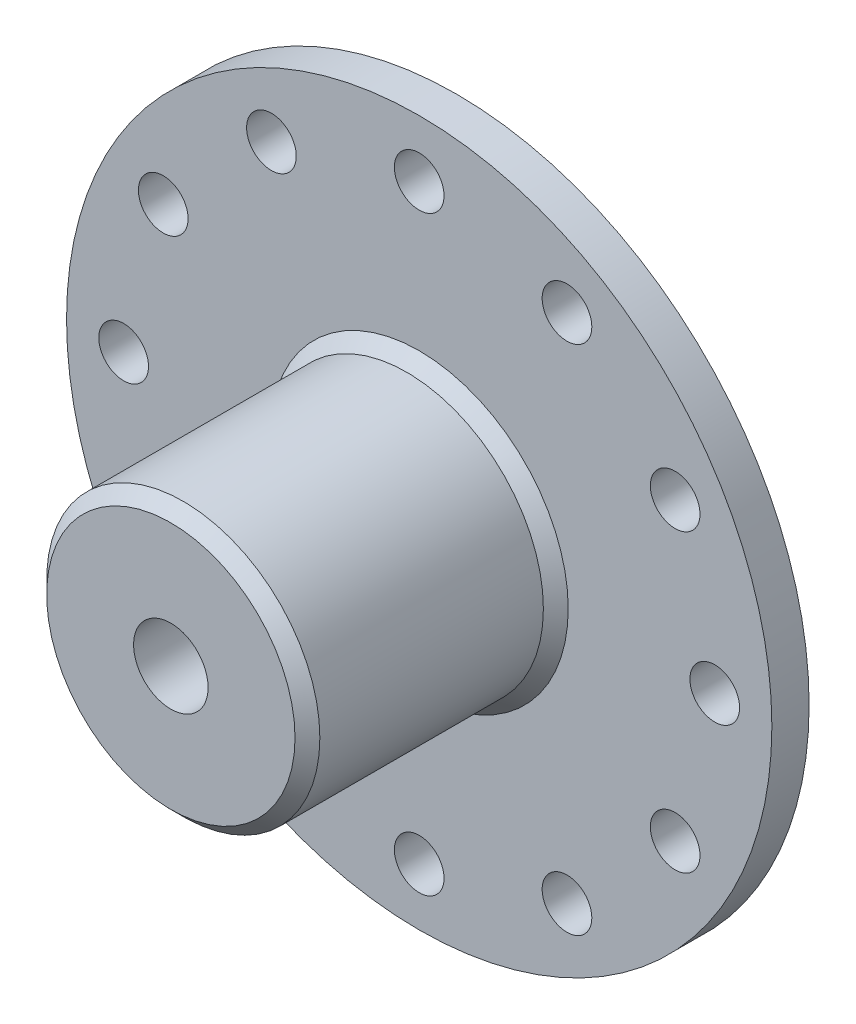
ISO-10303-21;
HEADER;
FILE_DESCRIPTION(('STEP AP214'),'2;1');
FILE_NAME('part.step','',(''),(''),'','','');
FILE_SCHEMA(('AUTOMOTIVE_DESIGN { 1 0 10303 214 1 1 1 1 }'));
ENDSEC;
DATA;
#1=APPLICATION_CONTEXT('core data for automotive mechanical design processes');
#2=APPLICATION_PROTOCOL_DEFINITION('international standard','automotive_design',2000,#1);
#3=PRODUCT_CONTEXT('',#1,'mechanical');
#4=PRODUCT('Part','Part','',(#3));
#5=PRODUCT_RELATED_PRODUCT_CATEGORY('part','',(#4));
#6=PRODUCT_DEFINITION_FORMATION('','',#4);
#7=PRODUCT_DEFINITION_CONTEXT('part definition',#1,'design');
#8=PRODUCT_DEFINITION('design','',#6,#7);
#9=PRODUCT_DEFINITION_SHAPE('','',#8);
#10=(LENGTH_UNIT() NAMED_UNIT(*) SI_UNIT(.MILLI.,.METRE.));
#11=(NAMED_UNIT(*) PLANE_ANGLE_UNIT() SI_UNIT($,.RADIAN.));
#12=(NAMED_UNIT(*) SI_UNIT($,.STERADIAN.) SOLID_ANGLE_UNIT());
#13=UNCERTAINTY_MEASURE_WITH_UNIT(LENGTH_MEASURE(1.E-05),#10,'distance_accuracy_value','');
#14=(GEOMETRIC_REPRESENTATION_CONTEXT(3) GLOBAL_UNCERTAINTY_ASSIGNED_CONTEXT((#13)) GLOBAL_UNIT_ASSIGNED_CONTEXT((#10,
#11,#12)) REPRESENTATION_CONTEXT('',''));
#15=CARTESIAN_POINT('',(0.,0.,0.));
#16=DIRECTION('',(0.,0.,1.));
#17=DIRECTION('',(1.,0.,0.));
#18=AXIS2_PLACEMENT_3D('',#15,#16,#17);
#19=CARTESIAN_POINT('',(0.,0.,3.));
#20=DIRECTION('',(0.,0.,-1.));
#21=DIRECTION('',(-1.,0.,0.));
#22=AXIS2_PLACEMENT_3D('',#19,#20,#21);
#23=CYLINDRICAL_SURFACE('',#22,28.4);
#24=CARTESIAN_POINT('',(0.,0.,3.));
#25=DIRECTION('',(0.,0.,1.));
#26=DIRECTION('',(1.,0.,0.));
#27=AXIS2_PLACEMENT_3D('',#24,#25,#26);
#28=CIRCLE('',#27,28.4);
#29=CARTESIAN_POINT('',(28.4,0.,3.));
#30=VERTEX_POINT('',#29);
#31=EDGE_CURVE('E62',#30,#30,#28,.T.);
#32=ORIENTED_EDGE('',*,*,#31,.F.);
#33=EDGE_LOOP('',(#32));
#34=FACE_BOUND('',#33,.T.);
#35=CARTESIAN_POINT('',(0.,0.,0.));
#36=DIRECTION('',(0.,0.,1.));
#37=DIRECTION('',(1.,0.,0.));
#38=AXIS2_PLACEMENT_3D('',#35,#36,#37);
#39=CIRCLE('',#38,28.4);
#40=CARTESIAN_POINT('',(28.4,0.,0.));
#41=VERTEX_POINT('',#40);
#42=EDGE_CURVE('E72',#41,#41,#39,.T.);
#43=ORIENTED_EDGE('',*,*,#42,.T.);
#44=EDGE_LOOP('',(#43));
#45=FACE_BOUND('',#44,.T.);
#46=ADVANCED_FACE('F42',(#34,#45),#23,.T.);
#47=CARTESIAN_POINT('',(0.,0.,3.));
#48=DIRECTION('',(0.,0.,1.));
#49=DIRECTION('',(1.,0.,0.));
#50=AXIS2_PLACEMENT_3D('',#47,#48,#49);
#51=PLANE('',#50);
#52=CARTESIAN_POINT('',(-11.8999999999999,20.6114046100697,3.));
#53=DIRECTION('',(0.,0.,1.));
#54=DIRECTION('',(0.499999999999998,0.86602540378444,0.));
#55=AXIS2_PLACEMENT_3D('',#52,#53,#54);
#56=CIRCLE('',#55,2.00000000000002);
#57=CARTESIAN_POINT('',(-10.8999999999999,22.3434554176386,3.));
#58=VERTEX_POINT('',#57);
#59=EDGE_CURVE('E208',#58,#58,#56,.T.);
#60=ORIENTED_EDGE('',*,*,#59,.F.);
#61=EDGE_LOOP('',(#60));
#62=FACE_BOUND('',#61,.T.);
#63=CARTESIAN_POINT('',(-20.6114046100696,11.9000000000001,3.));
#64=DIRECTION('',(0.,0.,1.));
#65=DIRECTION('',(0.,1.,0.));
#66=AXIS2_PLACEMENT_3D('',#63,#64,#65);
#67=CIRCLE('',#66,2.00000000000002);
#68=CARTESIAN_POINT('',(-20.6114046100696,13.9000000000001,3.));
#69=VERTEX_POINT('',#68);
#70=EDGE_CURVE('E202',#69,#69,#67,.T.);
#71=ORIENTED_EDGE('',*,*,#70,.F.);
#72=EDGE_LOOP('',(#71));
#73=FACE_BOUND('',#72,.T.);
#74=CARTESIAN_POINT('',(-23.8,0.,3.));
#75=DIRECTION('',(0.,0.,1.));
#76=DIRECTION('',(-0.500000000000004,0.866025403784436,0.));
#77=AXIS2_PLACEMENT_3D('',#74,#75,#76);
#78=CIRCLE('',#77,2.00000000000002);
#79=CARTESIAN_POINT('',(-24.8,1.73205080756898,3.));
#80=VERTEX_POINT('',#79);
#81=EDGE_CURVE('E196',#80,#80,#78,.T.);
#82=ORIENTED_EDGE('',*,*,#81,.F.);
#83=EDGE_LOOP('',(#82));
#84=FACE_BOUND('',#83,.T.);
#85=CARTESIAN_POINT('',(-20.6114046100697,-11.8999999999999,3.));
#86=DIRECTION('',(0.,0.,1.));
#87=DIRECTION('',(-0.866025403784442,0.499999999999995,0.));
#88=AXIS2_PLACEMENT_3D('',#85,#86,#87);
#89=CIRCLE('',#88,2.00000000000002);
#90=CARTESIAN_POINT('',(-22.3434554176386,-10.8999999999999,3.));
#91=VERTEX_POINT('',#90);
#92=EDGE_CURVE('E190',#91,#91,#89,.T.);
#93=ORIENTED_EDGE('',*,*,#92,.F.);
#94=EDGE_LOOP('',(#93));
#95=FACE_BOUND('',#94,.T.);
#96=CARTESIAN_POINT('',(-11.9000000000002,-20.6114046100695,3.));
#97=DIRECTION('',(0.,0.,1.));
#98=DIRECTION('',(-1.,0.,0.));
#99=AXIS2_PLACEMENT_3D('',#96,#97,#98);
#100=CIRCLE('',#99,2.00000000000002);
#101=CARTESIAN_POINT('',(-13.9000000000002,-20.6114046100695,3.));
#102=VERTEX_POINT('',#101);
#103=EDGE_CURVE('E184',#102,#102,#100,.T.);
#104=ORIENTED_EDGE('',*,*,#103,.F.);
#105=EDGE_LOOP('',(#104));
#106=FACE_BOUND('',#105,.T.);
#107=CARTESIAN_POINT('',(0.,-23.8,3.));
#108=DIRECTION('',(0.,0.,1.));
#109=DIRECTION('',(-0.866025403784435,-0.500000000000007,0.));
#110=AXIS2_PLACEMENT_3D('',#107,#108,#109);
#111=CIRCLE('',#110,2.00000000000002);
#112=CARTESIAN_POINT('',(-1.73205080756889,-24.8,3.));
#113=VERTEX_POINT('',#112);
#114=EDGE_CURVE('E178',#113,#113,#111,.T.);
#115=ORIENTED_EDGE('',*,*,#114,.F.);
#116=EDGE_LOOP('',(#115));
#117=FACE_BOUND('',#116,.T.);
#118=CARTESIAN_POINT('',(11.9,-20.6114046100696,3.));
#119=DIRECTION('',(0.,0.,1.));
#120=DIRECTION('',(-0.499999999999992,-0.866025403784443,0.));
#121=AXIS2_PLACEMENT_3D('',#118,#119,#120);
#122=CIRCLE('',#121,2.00000000000002);
#123=CARTESIAN_POINT('',(10.9,-22.3434554176385,3.));
#124=VERTEX_POINT('',#123);
#125=EDGE_CURVE('E172',#124,#124,#122,.T.);
#126=ORIENTED_EDGE('',*,*,#125,.F.);
#127=EDGE_LOOP('',(#126));
#128=FACE_BOUND('',#127,.T.);
#129=CARTESIAN_POINT('',(20.6114046100697,-11.9,3.));
#130=DIRECTION('',(0.,0.,1.));
#131=DIRECTION('',(0.,-1.,0.));
#132=AXIS2_PLACEMENT_3D('',#129,#130,#131);
#133=CIRCLE('',#132,2.00000000000002);
#134=CARTESIAN_POINT('',(20.6114046100697,-13.9,3.));
#135=VERTEX_POINT('',#134);
#136=EDGE_CURVE('E166',#135,#135,#133,.T.);
#137=ORIENTED_EDGE('',*,*,#136,.F.);
#138=EDGE_LOOP('',(#137));
#139=FACE_BOUND('',#138,.T.);
#140=CARTESIAN_POINT('',(23.8,0.,3.));
#141=DIRECTION('',(0.,0.,1.));
#142=DIRECTION('',(0.50000000000001,-0.866025403784433,0.));
#143=AXIS2_PLACEMENT_3D('',#140,#141,#142);
#144=CIRCLE('',#143,2.00000000000002);
#145=CARTESIAN_POINT('',(24.8,-1.7320508075688,3.));
#146=VERTEX_POINT('',#145);
#147=EDGE_CURVE('E160',#146,#146,#144,.T.);
#148=ORIENTED_EDGE('',*,*,#147,.F.);
#149=EDGE_LOOP('',(#148));
#150=FACE_BOUND('',#149,.T.);
#151=CARTESIAN_POINT('',(20.6114046100696,11.9000000000001,3.));
#152=DIRECTION('',(0.,0.,1.));
#153=DIRECTION('',(0.866025403784445,-0.499999999999989,0.));
#154=AXIS2_PLACEMENT_3D('',#151,#152,#153);
#155=CIRCLE('',#154,2.00000000000002);
#156=CARTESIAN_POINT('',(22.3434554176385,10.9000000000001,3.));
#157=VERTEX_POINT('',#156);
#158=EDGE_CURVE('E154',#157,#157,#155,.T.);
#159=ORIENTED_EDGE('',*,*,#158,.F.);
#160=EDGE_LOOP('',(#159));
#161=FACE_BOUND('',#160,.T.);
#162=CARTESIAN_POINT('',(1.73472347597681E-13,23.8,3.));
#163=DIRECTION('',(0.,0.,1.));
#164=DIRECTION('',(0.866025403784438,0.500000000000001,0.));
#165=AXIS2_PLACEMENT_3D('',#162,#163,#164);
#166=CIRCLE('',#165,2.00000000000002);
#167=CARTESIAN_POINT('',(1.73205080756906,24.8,3.));
#168=VERTEX_POINT('',#167);
#169=EDGE_CURVE('E146',#168,#168,#166,.T.);
#170=ORIENTED_EDGE('',*,*,#169,.F.);
#171=EDGE_LOOP('',(#170));
#172=FACE_BOUND('',#171,.T.);
#173=CARTESIAN_POINT('',(11.9000000000002,20.6114046100695,3.));
#174=DIRECTION('',(0.,0.,1.));
#175=DIRECTION('',(1.,0.,0.));
#176=AXIS2_PLACEMENT_3D('',#173,#174,#175);
#177=CIRCLE('',#176,2.00000000000002);
#178=CARTESIAN_POINT('',(13.9000000000002,20.6114046100695,3.));
#179=VERTEX_POINT('',#178);
#180=EDGE_CURVE('E94',#179,#179,#177,.T.);
#181=ORIENTED_EDGE('',*,*,#180,.F.);
#182=EDGE_LOOP('',(#181));
#183=FACE_BOUND('',#182,.T.);
#184=CARTESIAN_POINT('',(0.,0.,3.));
#185=DIRECTION('',(0.,0.,1.));
#186=DIRECTION('',(1.,0.,0.));
#187=AXIS2_PLACEMENT_3D('',#184,#185,#186);
#188=CIRCLE('',#187,12.);
#189=CARTESIAN_POINT('',(12.,0.,3.));
#190=VERTEX_POINT('',#189);
#191=EDGE_CURVE('E49',#190,#190,#188,.F.);
#192=ORIENTED_EDGE('',*,*,#191,.T.);
#193=EDGE_LOOP('',(#192));
#194=FACE_BOUND('',#193,.T.);
#195=ORIENTED_EDGE('',*,*,#31,.T.);
#196=EDGE_LOOP('',(#195));
#197=FACE_BOUND('',#196,.T.);
#198=ADVANCED_FACE('F105',(#62,#73,#84,#95,#106,#117,#128,#139,#150,#161,#172,#183,#194,#197),
#51,.T.);
#199=CARTESIAN_POINT('',(0.,0.,0.));
#200=DIRECTION('',(0.,0.,1.));
#201=DIRECTION('',(1.,0.,0.));
#202=AXIS2_PLACEMENT_3D('',#199,#200,#201);
#203=PLANE('',#202);
#204=CARTESIAN_POINT('',(-11.8999999999999,20.6114046100697,0.));
#205=DIRECTION('',(0.,0.,1.));
#206=DIRECTION('',(0.499999999999998,0.86602540378444,0.));
#207=AXIS2_PLACEMENT_3D('',#204,#205,#206);
#208=CIRCLE('',#207,2.00000000000002);
#209=CARTESIAN_POINT('',(-10.8999999999999,22.3434554176386,0.));
#210=VERTEX_POINT('',#209);
#211=EDGE_CURVE('E151',#210,#210,#208,.T.);
#212=ORIENTED_EDGE('',*,*,#211,.T.);
#213=EDGE_LOOP('',(#212));
#214=FACE_BOUND('',#213,.T.);
#215=CARTESIAN_POINT('',(-20.6114046100696,11.9000000000001,0.));
#216=DIRECTION('',(0.,0.,1.));
#217=DIRECTION('',(0.,1.,0.));
#218=AXIS2_PLACEMENT_3D('',#215,#216,#217);
#219=CIRCLE('',#218,2.00000000000002);
#220=CARTESIAN_POINT('',(-20.6114046100696,13.9000000000001,0.));
#221=VERTEX_POINT('',#220);
#222=EDGE_CURVE('E205',#221,#221,#219,.T.);
#223=ORIENTED_EDGE('',*,*,#222,.T.);
#224=EDGE_LOOP('',(#223));
#225=FACE_BOUND('',#224,.T.);
#226=CARTESIAN_POINT('',(-23.8,0.,0.));
#227=DIRECTION('',(0.,0.,1.));
#228=DIRECTION('',(-0.500000000000004,0.866025403784436,0.));
#229=AXIS2_PLACEMENT_3D('',#226,#227,#228);
#230=CIRCLE('',#229,2.00000000000002);
#231=CARTESIAN_POINT('',(-24.8,1.73205080756898,0.));
#232=VERTEX_POINT('',#231);
#233=EDGE_CURVE('E199',#232,#232,#230,.T.);
#234=ORIENTED_EDGE('',*,*,#233,.T.);
#235=EDGE_LOOP('',(#234));
#236=FACE_BOUND('',#235,.T.);
#237=CARTESIAN_POINT('',(-20.6114046100697,-11.8999999999999,0.));
#238=DIRECTION('',(0.,0.,1.));
#239=DIRECTION('',(-0.866025403784442,0.499999999999995,0.));
#240=AXIS2_PLACEMENT_3D('',#237,#238,#239);
#241=CIRCLE('',#240,2.00000000000002);
#242=CARTESIAN_POINT('',(-22.3434554176386,-10.8999999999999,0.));
#243=VERTEX_POINT('',#242);
#244=EDGE_CURVE('E193',#243,#243,#241,.T.);
#245=ORIENTED_EDGE('',*,*,#244,.T.);
#246=EDGE_LOOP('',(#245));
#247=FACE_BOUND('',#246,.T.);
#248=CARTESIAN_POINT('',(-11.9000000000002,-20.6114046100695,0.));
#249=DIRECTION('',(0.,0.,1.));
#250=DIRECTION('',(-1.,0.,0.));
#251=AXIS2_PLACEMENT_3D('',#248,#249,#250);
#252=CIRCLE('',#251,2.00000000000002);
#253=CARTESIAN_POINT('',(-13.9000000000002,-20.6114046100695,0.));
#254=VERTEX_POINT('',#253);
#255=EDGE_CURVE('E187',#254,#254,#252,.T.);
#256=ORIENTED_EDGE('',*,*,#255,.T.);
#257=EDGE_LOOP('',(#256));
#258=FACE_BOUND('',#257,.T.);
#259=CARTESIAN_POINT('',(0.,-23.8,0.));
#260=DIRECTION('',(0.,0.,1.));
#261=DIRECTION('',(-0.866025403784435,-0.500000000000007,0.));
#262=AXIS2_PLACEMENT_3D('',#259,#260,#261);
#263=CIRCLE('',#262,2.00000000000002);
#264=CARTESIAN_POINT('',(-1.73205080756889,-24.8,0.));
#265=VERTEX_POINT('',#264);
#266=EDGE_CURVE('E181',#265,#265,#263,.T.);
#267=ORIENTED_EDGE('',*,*,#266,.T.);
#268=EDGE_LOOP('',(#267));
#269=FACE_BOUND('',#268,.T.);
#270=CARTESIAN_POINT('',(11.9,-20.6114046100696,0.));
#271=DIRECTION('',(0.,0.,1.));
#272=DIRECTION('',(-0.499999999999992,-0.866025403784443,0.));
#273=AXIS2_PLACEMENT_3D('',#270,#271,#272);
#274=CIRCLE('',#273,2.00000000000002);
#275=CARTESIAN_POINT('',(10.9,-22.3434554176385,0.));
#276=VERTEX_POINT('',#275);
#277=EDGE_CURVE('E175',#276,#276,#274,.T.);
#278=ORIENTED_EDGE('',*,*,#277,.T.);
#279=EDGE_LOOP('',(#278));
#280=FACE_BOUND('',#279,.T.);
#281=CARTESIAN_POINT('',(20.6114046100697,-11.9,0.));
#282=DIRECTION('',(0.,0.,1.));
#283=DIRECTION('',(0.,-1.,0.));
#284=AXIS2_PLACEMENT_3D('',#281,#282,#283);
#285=CIRCLE('',#284,2.00000000000002);
#286=CARTESIAN_POINT('',(20.6114046100697,-13.9,0.));
#287=VERTEX_POINT('',#286);
#288=EDGE_CURVE('E169',#287,#287,#285,.T.);
#289=ORIENTED_EDGE('',*,*,#288,.T.);
#290=EDGE_LOOP('',(#289));
#291=FACE_BOUND('',#290,.T.);
#292=CARTESIAN_POINT('',(23.8,0.,0.));
#293=DIRECTION('',(0.,0.,1.));
#294=DIRECTION('',(0.50000000000001,-0.866025403784433,0.));
#295=AXIS2_PLACEMENT_3D('',#292,#293,#294);
#296=CIRCLE('',#295,2.00000000000002);
#297=CARTESIAN_POINT('',(24.8,-1.7320508075688,0.));
#298=VERTEX_POINT('',#297);
#299=EDGE_CURVE('E163',#298,#298,#296,.T.);
#300=ORIENTED_EDGE('',*,*,#299,.T.);
#301=EDGE_LOOP('',(#300));
#302=FACE_BOUND('',#301,.T.);
#303=CARTESIAN_POINT('',(20.6114046100696,11.9000000000001,0.));
#304=DIRECTION('',(0.,0.,1.));
#305=DIRECTION('',(0.866025403784445,-0.499999999999989,0.));
#306=AXIS2_PLACEMENT_3D('',#303,#304,#305);
#307=CIRCLE('',#306,2.00000000000002);
#308=CARTESIAN_POINT('',(22.3434554176385,10.9000000000001,0.));
#309=VERTEX_POINT('',#308);
#310=EDGE_CURVE('E157',#309,#309,#307,.T.);
#311=ORIENTED_EDGE('',*,*,#310,.T.);
#312=EDGE_LOOP('',(#311));
#313=FACE_BOUND('',#312,.T.);
#314=CARTESIAN_POINT('',(1.73472347597681E-13,23.8,0.));
#315=DIRECTION('',(0.,0.,1.));
#316=DIRECTION('',(0.866025403784438,0.500000000000001,0.));
#317=AXIS2_PLACEMENT_3D('',#314,#315,#316);
#318=CIRCLE('',#317,2.00000000000002);
#319=CARTESIAN_POINT('',(1.73205080756906,24.8,0.));
#320=VERTEX_POINT('',#319);
#321=EDGE_CURVE('E144',#320,#320,#318,.T.);
#322=ORIENTED_EDGE('',*,*,#321,.T.);
#323=EDGE_LOOP('',(#322));
#324=FACE_BOUND('',#323,.T.);
#325=CARTESIAN_POINT('',(11.9000000000002,20.6114046100695,0.));
#326=DIRECTION('',(0.,0.,1.));
#327=DIRECTION('',(1.,0.,0.));
#328=AXIS2_PLACEMENT_3D('',#325,#326,#327);
#329=CIRCLE('',#328,2.00000000000002);
#330=CARTESIAN_POINT('',(13.9000000000002,20.6114046100695,0.));
#331=VERTEX_POINT('',#330);
#332=EDGE_CURVE('E71',#331,#331,#329,.T.);
#333=ORIENTED_EDGE('',*,*,#332,.T.);
#334=EDGE_LOOP('',(#333));
#335=FACE_BOUND('',#334,.T.);
#336=CARTESIAN_POINT('',(0.,0.,0.));
#337=DIRECTION('',(0.,0.,1.));
#338=DIRECTION('',(1.,0.,0.));
#339=AXIS2_PLACEMENT_3D('',#336,#337,#338);
#340=CIRCLE('',#339,3.);
#341=CARTESIAN_POINT('',(3.,0.,0.));
#342=VERTEX_POINT('',#341);
#343=EDGE_CURVE('E96',#342,#342,#340,.T.);
#344=ORIENTED_EDGE('',*,*,#343,.T.);
#345=EDGE_LOOP('',(#344));
#346=FACE_BOUND('',#345,.T.);
#347=ORIENTED_EDGE('',*,*,#42,.F.);
#348=EDGE_LOOP('',(#347));
#349=FACE_BOUND('',#348,.T.);
#350=ADVANCED_FACE('F103',(#214,#225,#236,#247,#258,#269,#280,#291,#302,#313,#324,#335,#346,
#349),#203,.F.);
#351=CARTESIAN_POINT('',(0.,0.,23.));
#352=DIRECTION('',(0.,0.,-1.));
#353=DIRECTION('',(-1.,0.,0.));
#354=AXIS2_PLACEMENT_3D('',#351,#352,#353);
#355=CYLINDRICAL_SURFACE('',#354,11.);
#356=CARTESIAN_POINT('',(0.,0.,4.00000000000001));
#357=DIRECTION('',(0.,0.,1.));
#358=DIRECTION('',(1.,0.,0.));
#359=AXIS2_PLACEMENT_3D('',#356,#357,#358);
#360=CIRCLE('',#359,11.);
#361=CARTESIAN_POINT('',(11.,0.,4.00000000000001));
#362=VERTEX_POINT('',#361);
#363=EDGE_CURVE('E53',#362,#362,#360,.T.);
#364=ORIENTED_EDGE('',*,*,#363,.T.);
#365=EDGE_LOOP('',(#364));
#366=FACE_BOUND('',#365,.T.);
#367=CARTESIAN_POINT('',(0.,0.,22.));
#368=DIRECTION('',(0.,0.,1.));
#369=DIRECTION('',(1.,0.,0.));
#370=AXIS2_PLACEMENT_3D('',#367,#368,#369);
#371=CIRCLE('',#370,11.);
#372=CARTESIAN_POINT('',(11.,0.,22.));
#373=VERTEX_POINT('',#372);
#374=EDGE_CURVE('E57',#373,#373,#371,.F.);
#375=ORIENTED_EDGE('',*,*,#374,.T.);
#376=EDGE_LOOP('',(#375));
#377=FACE_BOUND('',#376,.T.);
#378=CARTESIAN_POINT('',(0.,-11.,17.));
#379=CARTESIAN_POINT('',(0.111357271644373,-10.9999980072786,16.9999956813393));
#380=CARTESIAN_POINT('',(0.222771449918202,-10.9982915273343,16.9906682425174));
#381=CARTESIAN_POINT('',(0.442464406848309,-10.99164847502,16.9536265339751));
#382=CARTESIAN_POINT('',(0.550740387266074,-10.9867091072254,16.9258963514186));
#383=CARTESIAN_POINT('',(0.760947572513749,-10.9741532323507,16.852922870329));
#384=CARTESIAN_POINT('',(0.862884263930179,-10.9665390793192,16.8076949678102));
#385=CARTESIAN_POINT('',(1.0577120033845,-10.949466714983,16.7010526688082));
#386=CARTESIAN_POINT('',(1.15060386767905,-10.9400086703132,16.6396397348118));
#387=CARTESIAN_POINT('',(1.32576444051239,-10.9201743349983,16.5016340903573));
#388=CARTESIAN_POINT('',(1.40791622603346,-10.9097897259708,16.4248941580192));
#389=CARTESIAN_POINT('',(1.55825357341079,-10.8893349521181,16.2587296459102));
#390=CARTESIAN_POINT('',(1.62643816794977,-10.8792648091126,16.1693041883108));
#391=CARTESIAN_POINT('',(1.74738695016477,-10.8604984020977,15.9794872705402));
#392=CARTESIAN_POINT('',(1.80003313265556,-10.851812871101,15.8790194647696));
#393=CARTESIAN_POINT('',(1.88765546949978,-10.836915832769,15.670481349676));
#394=CARTESIAN_POINT('',(1.92263305283275,-10.8307041253674,15.562411655975));
#395=CARTESIAN_POINT('',(1.97355197711315,-10.8215415351671,15.3429853506434));
#396=CARTESIAN_POINT('',(1.98969666425445,-10.8185558462234,15.2316774082904));
#397=CARTESIAN_POINT('',(2.00312248736688,-10.8160783143231,15.0078955926854));
#398=CARTESIAN_POINT('',(2.00040521296643,-10.8165861769405,14.895421818484));
#399=CARTESIAN_POINT('',(1.97634934427,-10.8210066504918,14.673968085867));
#400=CARTESIAN_POINT('',(1.95524117699072,-10.8248771281426,14.5649621321043));
#401=CARTESIAN_POINT('',(1.89536523340026,-10.8355206127391,14.3520649816328));
#402=CARTESIAN_POINT('',(1.85659674743188,-10.8422937363232,14.2481739906482));
#403=CARTESIAN_POINT('',(1.76227297789295,-10.8580238155272,14.0477772092213));
#404=CARTESIAN_POINT('',(1.7066239037154,-10.8669929171435,13.9513165573339));
#405=CARTESIAN_POINT('',(1.58018503374043,-10.8860962201172,13.7690152630547));
#406=CARTESIAN_POINT('',(1.50939379023584,-10.8962305328347,13.6831756373538));
#407=CARTESIAN_POINT('',(1.35343399418352,-10.9167064080854,13.5232210035556));
#408=CARTESIAN_POINT('',(1.2680681726569,-10.9270488181647,13.4492983115631));
#409=CARTESIAN_POINT('',(1.08604454069331,-10.9466375043709,13.3167948665192));
#410=CARTESIAN_POINT('',(0.989386629498157,-10.9558837707156,13.2582142503787));
#411=CARTESIAN_POINT('',(0.787327598497296,-10.9722553782534,13.158032610215));
#412=CARTESIAN_POINT('',(0.681916780395491,-10.9793783255922,13.116450731304));
#413=CARTESIAN_POINT('',(0.465448414462665,-10.9906820547088,13.0516368075063));
#414=CARTESIAN_POINT('',(0.354391431316063,-10.994863130091,13.0284029314261));
#415=CARTESIAN_POINT('',(0.131438649578498,-10.9997719337866,13.0012102380809));
#416=CARTESIAN_POINT('',(0.019576012108933,-11.0005468934114,12.9969877765459));
#417=CARTESIAN_POINT('',(-0.203257238970968,-10.998686302475,13.0072317981815));
#418=CARTESIAN_POINT('',(-0.314227893453083,-10.9960509090871,13.0216974200717));
#419=CARTESIAN_POINT('',(-0.531297097592759,-10.9876950863245,13.0686877495619));
#420=CARTESIAN_POINT('',(-0.637425297458318,-10.9819973157216,13.1010798691828));
#421=CARTESIAN_POINT('',(-0.842744713756611,-10.9681529512222,13.1828608285219));
#422=CARTESIAN_POINT('',(-0.94193548096095,-10.9600061989244,13.2322507676977));
#423=CARTESIAN_POINT('',(-1.13169524707494,-10.9420497958484,13.3472146378029));
#424=CARTESIAN_POINT('',(-1.22216445208488,-10.932223816146,13.4129506871559));
#425=CARTESIAN_POINT('',(-1.39088213822347,-10.9120428807109,13.5585203766711));
#426=CARTESIAN_POINT('',(-1.46912954974332,-10.901687878785,13.6383552494119));
#427=CARTESIAN_POINT('',(-1.6121773788768,-10.8814603955764,13.8110468814485));
#428=CARTESIAN_POINT('',(-1.67679836741418,-10.8715955212189,13.9040533065259));
#429=CARTESIAN_POINT('',(-1.78949986552014,-10.8536151008102,14.0997561814065));
#430=CARTESIAN_POINT('',(-1.83758096630795,-10.8454994922354,14.2024522846844));
#431=CARTESIAN_POINT('',(-1.91557945241746,-10.8319954461548,14.4141507496917));
#432=CARTESIAN_POINT('',(-1.9455810786184,-10.8265943801675,14.5231212307381));
#433=CARTESIAN_POINT('',(-1.98683040178554,-10.8191012654539,14.7446629886311));
#434=CARTESIAN_POINT('',(-1.99808007453629,-10.8170088681136,14.8572338848489));
#435=CARTESIAN_POINT('',(-2.00144313663184,-10.8163869388262,15.0809853754636));
#436=CARTESIAN_POINT('',(-1.99383937001232,-10.8178047454411,15.1921616714385));
#437=CARTESIAN_POINT('',(-1.96032846912815,-10.8239270874703,15.4116236380174));
#438=CARTESIAN_POINT('',(-1.93442142905718,-10.8286316059701,15.5199093234943));
#439=CARTESIAN_POINT('',(-1.86515567158476,-10.8407757208091,15.7303761973954));
#440=CARTESIAN_POINT('',(-1.82182581019232,-10.8482107929975,15.8325671602234));
#441=CARTESIAN_POINT('',(-1.71897473664823,-10.8649817751485,16.0282744471647));
#442=CARTESIAN_POINT('',(-1.65945247569007,-10.8743178082294,16.1217902088456));
#443=CARTESIAN_POINT('',(-1.52491543662799,-10.8940032465147,16.2989128745956));
#444=CARTESIAN_POINT('',(-1.44969415553099,-10.9043650783111,16.3823615698708));
#445=CARTESIAN_POINT('',(-1.28632651423364,-10.9248399206865,16.5355470810122));
#446=CARTESIAN_POINT('',(-1.19817718680093,-10.9349528735191,16.6052807403922));
#447=CARTESIAN_POINT('',(-1.0105711896463,-10.9538897429719,16.7296002971235));
#448=CARTESIAN_POINT('',(-0.911025849790496,-10.9627021317343,16.7840541851801));
#449=CARTESIAN_POINT('',(-0.704073905086345,-10.9779326099335,16.8753792160741));
#450=CARTESIAN_POINT('',(-0.596674925486671,-10.9843529858473,16.9122671592783));
#451=CARTESIAN_POINT('',(-0.407441749458407,-10.9927407037649,16.9597754303022));
#452=CARTESIAN_POINT('',(-0.326725427276491,-10.9954478027358,16.9748343329604));
#453=CARTESIAN_POINT('',(-0.164016342132203,-10.9990781643304,16.9949480937949));
#454=CARTESIAN_POINT('',(-0.0820236084408332,-11.0000014678,17.0000031810418));
#455=CARTESIAN_POINT('',(0.,-11.,17.));
#456=B_SPLINE_CURVE_WITH_KNOTS('',3,(#378,#379,#380,#381,#382,#383,#384,#385,#386,#387,#388,
#389,#390,#391,#392,#393,#394,#395,#396,#397,#398,#399,#400,#401,#402,#403,#404,#405,#406,#407,
#408,#409,#410,#411,#412,#413,#414,#415,#416,#417,#418,#419,#420,#421,#422,#423,#424,#425,#426,
#427,#428,#429,#430,#431,#432,#433,#434,#435,#436,#437,#438,#439,#440,#441,#442,#443,#444,#445,
#446,#447,#448,#449,#450,#451,#452,#453,#454,#455),.UNSPECIFIED.,.T.,.F.,(4,2,2,2,2,2,2,2,2,2,2,
2,2,2,2,2,2,2,2,2,2,2,2,2,2,2,2,2,2,2,2,2,2,2,2,2,2,2,4),(0.,0.333771891552332,
0.667832772072591,1.00160038286675,1.3353378446015,1.67245014596885,2.00958578663079,
2.3492195220365,2.6888257845573,3.02473021172645,3.36060633024203,3.69233367290895,
4.02407434678871,4.35769306461625,4.69134369321255,5.02993210441872,5.36852353704646,
5.70749527023812,6.04643316861453,6.38065600997364,6.71486344850797,7.0466314328543,
7.37842088074221,7.71364226795666,8.04889297616123,8.38831506130458,8.72772501252474,
9.06554101076157,9.40332141303601,9.73606509730371,10.0688070691931,10.4010002025896,
10.733214857769,11.0701111453004,11.4070848782946,11.7468860454293,12.0863615649817,
12.3322171022956,12.5780670098676),.UNSPECIFIED.);
#457=CARTESIAN_POINT('',(0.,-11.,17.));
#458=VERTEX_POINT('',#457);
#459=EDGE_CURVE('E70',#458,#458,#456,.T.);
#460=ORIENTED_EDGE('',*,*,#459,.T.);
#461=EDGE_LOOP('',(#460));
#462=FACE_BOUND('',#461,.T.);
#463=ADVANCED_FACE('F98',(#366,#377,#462),#355,.T.);
#464=CARTESIAN_POINT('',(0.,0.,23.));
#465=DIRECTION('',(0.,0.,1.));
#466=DIRECTION('',(1.,0.,0.));
#467=AXIS2_PLACEMENT_3D('',#464,#465,#466);
#468=PLANE('',#467);
#469=CARTESIAN_POINT('',(0.,0.,23.));
#470=DIRECTION('',(0.,0.,1.));
#471=DIRECTION('',(1.,0.,0.));
#472=AXIS2_PLACEMENT_3D('',#469,#470,#471);
#473=CIRCLE('',#472,10.);
#474=CARTESIAN_POINT('',(10.,0.,23.));
#475=VERTEX_POINT('',#474);
#476=EDGE_CURVE('E12',#475,#475,#473,.T.);
#477=ORIENTED_EDGE('',*,*,#476,.T.);
#478=EDGE_LOOP('',(#477));
#479=FACE_BOUND('',#478,.T.);
#480=CARTESIAN_POINT('',(0.,0.,23.));
#481=DIRECTION('',(0.,0.,1.));
#482=DIRECTION('',(1.,0.,0.));
#483=AXIS2_PLACEMENT_3D('',#480,#481,#482);
#484=CIRCLE('',#483,3.);
#485=CARTESIAN_POINT('',(3.,0.,23.));
#486=VERTEX_POINT('',#485);
#487=EDGE_CURVE('E93',#486,#486,#484,.T.);
#488=ORIENTED_EDGE('',*,*,#487,.F.);
#489=EDGE_LOOP('',(#488));
#490=FACE_BOUND('',#489,.T.);
#491=ADVANCED_FACE('F102',(#479,#490),#468,.T.);
#492=CARTESIAN_POINT('',(0.,0.,0.));
#493=DIRECTION('',(0.,0.,1.));
#494=DIRECTION('',(1.,0.,0.));
#495=AXIS2_PLACEMENT_3D('',#492,#493,#494);
#496=CYLINDRICAL_SURFACE('',#495,3.);
#497=CARTESIAN_POINT('',(0.,-3.,17.));
#498=CARTESIAN_POINT('',(-0.100484716668078,-3.0000004164484,17.0000005496325));
#499=CARTESIAN_POINT('',(-0.200969087132901,-2.99490802753388,16.9923860300445));
#500=CARTESIAN_POINT('',(-0.398733058031681,-2.97504652423809,16.9624031358943));
#501=CARTESIAN_POINT('',(-0.496011113955007,-2.96027281581235,16.9400277568767));
#502=CARTESIAN_POINT('',(-0.684212307854249,-2.92250482404708,16.8818922826752));
#503=CARTESIAN_POINT('',(-0.775162872657555,-2.89954905493315,16.8461948599921));
#504=CARTESIAN_POINT('',(-0.94941529099726,-2.8472613787744,16.7629366367285));
#505=CARTESIAN_POINT('',(-1.03271603160967,-2.8179285460551,16.7153741136994));
#506=CARTESIAN_POINT('',(-1.19728470077011,-2.75227329369838,16.6053430626326));
#507=CARTESIAN_POINT('',(-1.27778030546067,-2.71556897579319,16.5419521392571));
#508=CARTESIAN_POINT('',(-1.42772804469274,-2.63982313083466,16.4042699513416));
#509=CARTESIAN_POINT('',(-1.49716405543888,-2.60077830356832,16.3299630701623));
#510=CARTESIAN_POINT('',(-1.63422297745496,-2.51728264678794,16.1589476323873));
#511=CARTESIAN_POINT('',(-1.6998318636275,-2.47295067937795,16.0605543467965));
#512=CARTESIAN_POINT('',(-1.81350357014175,-2.3908414735282,15.8516366223535));
#513=CARTESIAN_POINT('',(-1.86159673426503,-2.35305295954668,15.7411335984373));
#514=CARTESIAN_POINT('',(-1.92674035011438,-2.29976266641461,15.5432887065784));
#515=CARTESIAN_POINT('',(-1.94874447236008,-2.28097627892403,15.4584715471261));
#516=CARTESIAN_POINT('',(-1.98150617785228,-2.25257969659604,15.2852554952583));
#517=CARTESIAN_POINT('',(-1.99228314651963,-2.24295368744147,15.1968630512739));
#518=CARTESIAN_POINT('',(-2.00191364141227,-2.23436605608045,15.0185252211435));
#519=CARTESIAN_POINT('',(-2.00071842917524,-2.23544802558502,14.9285749765476));
#520=CARTESIAN_POINT('',(-1.98637581333356,-2.24819775483425,14.7503650265002));
#521=CARTESIAN_POINT('',(-1.97321828380393,-2.25987448286881,14.6621068179719));
#522=CARTESIAN_POINT('',(-1.93664994217326,-2.2912718598996,14.4935329487581));
#523=CARTESIAN_POINT('',(-1.91371711479477,-2.31061488324375,14.4130386640612));
#524=CARTESIAN_POINT('',(-1.85870118583424,-2.35509622933623,14.2569763090242));
#525=CARTESIAN_POINT('',(-1.8266150732855,-2.3802364585489,14.1814098697613));
#526=CARTESIAN_POINT('',(-1.74673818732648,-2.43964196377947,14.0209746046436));
#527=CARTESIAN_POINT('',(-1.69708052300444,-2.47472317740627,13.9373400995169));
#528=CARTESIAN_POINT('',(-1.5866896043822,-2.54691537733438,13.7786166047142));
#529=CARTESIAN_POINT('',(-1.52594268999614,-2.58402882709328,13.7035383422379));
#530=CARTESIAN_POINT('',(-1.37981165322308,-2.66543343763725,13.5474574543966));
#531=CARTESIAN_POINT('',(-1.29193938283656,-2.70954744720561,13.4686659513172));
#532=CARTESIAN_POINT('',(-1.10200799908007,-2.79218100665212,13.3268035054615));
#533=CARTESIAN_POINT('',(-0.999962299343691,-2.83070577648042,13.263717854591));
#534=CARTESIAN_POINT('',(-0.804857827096524,-2.89145404090364,13.1665222813771));
#535=CARTESIAN_POINT('',(-0.713957643371904,-2.9153926116554,13.1291566366611));
#536=CARTESIAN_POINT('',(-0.526036043935474,-2.95507719030499,13.0678950743746));
#537=CARTESIAN_POINT('',(-0.429019879001644,-2.97083012127544,13.0439877728678));
#538=CARTESIAN_POINT('',(-0.230985453172275,-2.99275882156808,13.010838834762));
#539=CARTESIAN_POINT('',(-0.129951811934152,-2.99889322461187,13.0016605390617));
#540=CARTESIAN_POINT('',(0.0724415193893518,-3.00083114965147,12.9987529114378));
#541=CARTESIAN_POINT('',(0.17380118618663,-2.99663539385634,13.0050224995112));
#542=CARTESIAN_POINT('',(0.366455717204244,-2.97899589424273,13.031624055562));
#543=CARTESIAN_POINT('',(0.457957444679197,-2.96622246390226,13.0509372977552));
#544=CARTESIAN_POINT('',(0.636116392427405,-2.93318449284837,13.1015956860129));
#545=CARTESIAN_POINT('',(0.722772837571137,-2.91291875746989,13.1329427509282));
#546=CARTESIAN_POINT('',(0.894664750466001,-2.86496352529157,13.2086522970449));
#547=CARTESIAN_POINT('',(0.979496184631423,-2.83689870135785,13.2536881540819));
#548=CARTESIAN_POINT('',(1.1406830239573,-2.7760185561151,13.3544332899463));
#549=CARTESIAN_POINT('',(1.21703314820091,-2.74320030403941,13.4101491605322));
#550=CARTESIAN_POINT('',(1.37185445482324,-2.6695454665343,13.5406078681575));
#551=CARTESIAN_POINT('',(1.44875187569565,-2.62826156800165,13.6169662600751));
#552=CARTESIAN_POINT('',(1.58933968069449,-2.54571173085957,13.7811114299571));
#553=CARTESIAN_POINT('',(1.6530209365723,-2.50444582417845,13.8689060391075));
#554=CARTESIAN_POINT('',(1.76124776549314,-2.4293967897058,14.0471424127681));
#555=CARTESIAN_POINT('',(1.80695636125283,-2.39527597025701,14.1367320334622));
#556=CARTESIAN_POINT('',(1.88496213740264,-2.33438974266154,14.3238726524436));
#557=CARTESIAN_POINT('',(1.91728345682189,-2.30761112529822,14.4214089383046));
#558=CARTESIAN_POINT('',(1.9623584346534,-2.26933208182633,14.6045644871954));
#559=CARTESIAN_POINT('',(1.97758597566225,-2.25594998021257,14.689171809876));
#560=CARTESIAN_POINT('',(1.99699205923373,-2.23879466438398,14.8605732813184));
#561=CARTESIAN_POINT('',(2.00118260285317,-2.23501101347816,14.9473649511395));
#562=CARTESIAN_POINT('',(1.99823921981266,-2.23764201149981,15.1206430567237));
#563=CARTESIAN_POINT('',(1.99109858767783,-2.24406269907463,15.2071292813738));
#564=CARTESIAN_POINT('',(1.96596997224746,-2.26610452403491,15.3773435285321));
#565=CARTESIAN_POINT('',(1.94796751728257,-2.28173793527615,15.4610677138243));
#566=CARTESIAN_POINT('',(1.89593035657494,-2.32526843904801,15.6457111864812));
#567=CARTESIAN_POINT('',(1.85890187130765,-2.35532333574983,15.7452677129433));
#568=CARTESIAN_POINT('',(1.7708452623622,-2.42222161121309,15.9354868343842));
#569=CARTESIAN_POINT('',(1.71979748341259,-2.459074496867,16.0261366979917));
#570=CARTESIAN_POINT('',(1.60398280555152,-2.53617186577119,16.1992818871362));
#571=CARTESIAN_POINT('',(1.5389830989402,-2.5764658739228,16.2815987454231));
#572=CARTESIAN_POINT('',(1.39671768031094,-2.65628301537844,16.4353224782579));
#573=CARTESIAN_POINT('',(1.31944821025748,-2.69580590832396,16.5067259970292));
#574=CARTESIAN_POINT('',(1.14145732976973,-2.77631551964083,16.6467121043091));
#575=CARTESIAN_POINT('',(1.03896166955574,-2.81669805449991,16.7134186401783));
#576=CARTESIAN_POINT('',(0.820868555771208,-2.88777665874161,16.8279132766653));
#577=CARTESIAN_POINT('',(0.705292062449148,-2.91848793445255,16.875731106824));
#578=CARTESIAN_POINT('',(0.491435069835737,-2.96101644836895,16.9411545781638));
#579=CARTESIAN_POINT('',(0.395012325257914,-2.97551480368935,16.9631110390986));
#580=CARTESIAN_POINT('',(0.199058012023941,-2.99500280141853,16.9925280325381));
#581=CARTESIAN_POINT('',(0.0995288361880056,-2.99999958751315,16.999999455596));
#582=CARTESIAN_POINT('',(0.,-3.,17.));
#583=B_SPLINE_CURVE_WITH_KNOTS('',3,(#497,#498,#499,#500,#501,#502,#503,#504,#505,#506,#507,
#508,#509,#510,#511,#512,#513,#514,#515,#516,#517,#518,#519,#520,#521,#522,#523,#524,#525,#526,
#527,#528,#529,#530,#531,#532,#533,#534,#535,#536,#537,#538,#539,#540,#541,#542,#543,#544,#545,
#546,#547,#548,#549,#550,#551,#552,#553,#554,#555,#556,#557,#558,#559,#560,#561,#562,#563,#564,
#565,#566,#567,#568,#569,#570,#571,#572,#573,#574,#575,#576,#577,#578,#579,#580,#581,#582),
.UNSPECIFIED.,.T.,.F.,(4,2,2,2,2,2,2,2,2,2,2,2,2,2,2,2,2,2,2,2,2,2,2,2,2,2,2,2,2,2,2,2,2,2,2,2,
2,2,2,2,2,2,4),(0.,0.3010532265054,0.602249414348689,0.902046153190233,1.20188643867387,
1.52717029000557,1.85292411604319,2.23006683295983,2.60655305445439,2.87433693676029,
3.14165767845809,3.41006711735378,3.67870397263352,3.93548862198022,4.19235783805079,
4.50147574660874,4.81097703780057,5.18718954496753,5.56304840301363,5.86524087696759,
6.16717735142814,6.47040883294251,6.77361911533415,7.05553084792473,7.33748755138271,
7.63652346829516,7.93574454945204,8.28228176141292,8.62905753175758,8.94649935304477,
9.26336626640723,9.52324048016135,9.78283200333091,10.0425772028455,10.302669238524,
10.6320660870419,10.9619271337795,11.2977924520448,11.6337608397015,12.0179535155883,
12.4015390656083,12.6999529136674,12.9981423125957),.UNSPECIFIED.);
#584=CARTESIAN_POINT('',(0.,-3.,17.));
#585=VERTEX_POINT('',#584);
#586=EDGE_CURVE('E63',#585,#585,#583,.T.);
#587=ORIENTED_EDGE('',*,*,#586,.T.);
#588=EDGE_LOOP('',(#587));
#589=FACE_BOUND('',#588,.T.);
#590=ORIENTED_EDGE('',*,*,#343,.F.);
#591=EDGE_LOOP('',(#590));
#592=FACE_BOUND('',#591,.T.);
#593=ORIENTED_EDGE('',*,*,#487,.T.);
#594=EDGE_LOOP('',(#593));
#595=FACE_BOUND('',#594,.T.);
#596=ADVANCED_FACE('F74',(#589,#592,#595),#496,.F.);
#597=CARTESIAN_POINT('',(0.,-15.,15.));
#598=DIRECTION('',(0.,1.,0.));
#599=DIRECTION('',(0.,0.,1.));
#600=AXIS2_PLACEMENT_3D('',#597,#598,#599);
#601=CYLINDRICAL_SURFACE('',#600,2.);
#602=ORIENTED_EDGE('',*,*,#586,.F.);
#603=EDGE_LOOP('',(#602));
#604=FACE_BOUND('',#603,.T.);
#605=ORIENTED_EDGE('',*,*,#459,.F.);
#606=EDGE_LOOP('',(#605));
#607=FACE_BOUND('',#606,.T.);
#608=ADVANCED_FACE('F77',(#604,#607),#601,.F.);
#609=CARTESIAN_POINT('',(0.,0.,4.00000000000001));
#610=DIRECTION('',(0.,0.,-1.));
#611=DIRECTION('',(-1.,0.,0.));
#612=AXIS2_PLACEMENT_3D('',#609,#610,#611);
#613=CONICAL_SURFACE('',#612,11.,0.785398163397443);
#614=ORIENTED_EDGE('',*,*,#191,.F.);
#615=EDGE_LOOP('',(#614));
#616=FACE_BOUND('',#615,.T.);
#617=ORIENTED_EDGE('',*,*,#363,.F.);
#618=EDGE_LOOP('',(#617));
#619=FACE_BOUND('',#618,.T.);
#620=ADVANCED_FACE('F81',(#616,#619),#613,.T.);
#621=CARTESIAN_POINT('',(0.,0.,23.));
#622=DIRECTION('',(0.,0.,-1.));
#623=DIRECTION('',(-1.,0.,0.));
#624=AXIS2_PLACEMENT_3D('',#621,#622,#623);
#625=CONICAL_SURFACE('',#624,10.,0.785398163397443);
#626=ORIENTED_EDGE('',*,*,#374,.F.);
#627=EDGE_LOOP('',(#626));
#628=FACE_BOUND('',#627,.T.);
#629=ORIENTED_EDGE('',*,*,#476,.F.);
#630=EDGE_LOOP('',(#629));
#631=FACE_BOUND('',#630,.T.);
#632=ADVANCED_FACE('F44',(#628,#631),#625,.T.);
#633=CARTESIAN_POINT('',(11.9000000000002,20.6114046100695,0.));
#634=DIRECTION('',(0.,0.,1.));
#635=DIRECTION('',(1.,0.,0.));
#636=AXIS2_PLACEMENT_3D('',#633,#634,#635);
#637=CYLINDRICAL_SURFACE('',#636,2.00000000000002);
#638=ORIENTED_EDGE('',*,*,#332,.F.);
#639=EDGE_LOOP('',(#638));
#640=FACE_BOUND('',#639,.T.);
#641=ORIENTED_EDGE('',*,*,#180,.T.);
#642=EDGE_LOOP('',(#641));
#643=FACE_BOUND('',#642,.T.);
#644=ADVANCED_FACE('F83',(#640,#643),#637,.F.);
#645=CARTESIAN_POINT('',(1.73472347597681E-13,23.8,0.));
#646=DIRECTION('',(0.,0.,1.));
#647=DIRECTION('',(1.,0.,0.));
#648=AXIS2_PLACEMENT_3D('',#645,#646,#647);
#649=CYLINDRICAL_SURFACE('',#648,2.00000000000002);
#650=ORIENTED_EDGE('',*,*,#321,.F.);
#651=EDGE_LOOP('',(#650));
#652=FACE_BOUND('',#651,.T.);
#653=ORIENTED_EDGE('',*,*,#169,.T.);
#654=EDGE_LOOP('',(#653));
#655=FACE_BOUND('',#654,.T.);
#656=ADVANCED_FACE('F131',(#652,#655),#649,.F.);
#657=CARTESIAN_POINT('',(20.6114046100696,11.9000000000001,0.));
#658=DIRECTION('',(0.,0.,1.));
#659=DIRECTION('',(1.,0.,0.));
#660=AXIS2_PLACEMENT_3D('',#657,#658,#659);
#661=CYLINDRICAL_SURFACE('',#660,2.00000000000002);
#662=ORIENTED_EDGE('',*,*,#310,.F.);
#663=EDGE_LOOP('',(#662));
#664=FACE_BOUND('',#663,.T.);
#665=ORIENTED_EDGE('',*,*,#158,.T.);
#666=EDGE_LOOP('',(#665));
#667=FACE_BOUND('',#666,.T.);
#668=ADVANCED_FACE('F136',(#664,#667),#661,.F.);
#669=CARTESIAN_POINT('',(23.8,0.,0.));
#670=DIRECTION('',(0.,0.,1.));
#671=DIRECTION('',(1.,0.,0.));
#672=AXIS2_PLACEMENT_3D('',#669,#670,#671);
#673=CYLINDRICAL_SURFACE('',#672,2.00000000000002);
#674=ORIENTED_EDGE('',*,*,#299,.F.);
#675=EDGE_LOOP('',(#674));
#676=FACE_BOUND('',#675,.T.);
#677=ORIENTED_EDGE('',*,*,#147,.T.);
#678=EDGE_LOOP('',(#677));
#679=FACE_BOUND('',#678,.T.);
#680=ADVANCED_FACE('F315',(#676,#679),#673,.F.);
#681=CARTESIAN_POINT('',(20.6114046100697,-11.9,0.));
#682=DIRECTION('',(0.,0.,1.));
#683=DIRECTION('',(1.,0.,0.));
#684=AXIS2_PLACEMENT_3D('',#681,#682,#683);
#685=CYLINDRICAL_SURFACE('',#684,2.00000000000002);
#686=ORIENTED_EDGE('',*,*,#288,.F.);
#687=EDGE_LOOP('',(#686));
#688=FACE_BOUND('',#687,.T.);
#689=ORIENTED_EDGE('',*,*,#136,.T.);
#690=EDGE_LOOP('',(#689));
#691=FACE_BOUND('',#690,.T.);
#692=ADVANCED_FACE('F324',(#688,#691),#685,.F.);
#693=CARTESIAN_POINT('',(11.9,-20.6114046100696,0.));
#694=DIRECTION('',(0.,0.,1.));
#695=DIRECTION('',(1.,0.,0.));
#696=AXIS2_PLACEMENT_3D('',#693,#694,#695);
#697=CYLINDRICAL_SURFACE('',#696,2.00000000000002);
#698=ORIENTED_EDGE('',*,*,#277,.F.);
#699=EDGE_LOOP('',(#698));
#700=FACE_BOUND('',#699,.T.);
#701=ORIENTED_EDGE('',*,*,#125,.T.);
#702=EDGE_LOOP('',(#701));
#703=FACE_BOUND('',#702,.T.);
#704=ADVANCED_FACE('F333',(#700,#703),#697,.F.);
#705=CARTESIAN_POINT('',(0.,-23.8,0.));
#706=DIRECTION('',(0.,0.,1.));
#707=DIRECTION('',(1.,0.,0.));
#708=AXIS2_PLACEMENT_3D('',#705,#706,#707);
#709=CYLINDRICAL_SURFACE('',#708,2.00000000000002);
#710=ORIENTED_EDGE('',*,*,#266,.F.);
#711=EDGE_LOOP('',(#710));
#712=FACE_BOUND('',#711,.T.);
#713=ORIENTED_EDGE('',*,*,#114,.T.);
#714=EDGE_LOOP('',(#713));
#715=FACE_BOUND('',#714,.T.);
#716=ADVANCED_FACE('F342',(#712,#715),#709,.F.);
#717=CARTESIAN_POINT('',(-11.9000000000002,-20.6114046100695,0.));
#718=DIRECTION('',(0.,0.,1.));
#719=DIRECTION('',(1.,0.,0.));
#720=AXIS2_PLACEMENT_3D('',#717,#718,#719);
#721=CYLINDRICAL_SURFACE('',#720,2.00000000000002);
#722=ORIENTED_EDGE('',*,*,#255,.F.);
#723=EDGE_LOOP('',(#722));
#724=FACE_BOUND('',#723,.T.);
#725=ORIENTED_EDGE('',*,*,#103,.T.);
#726=EDGE_LOOP('',(#725));
#727=FACE_BOUND('',#726,.T.);
#728=ADVANCED_FACE('F351',(#724,#727),#721,.F.);
#729=CARTESIAN_POINT('',(-20.6114046100697,-11.8999999999999,0.));
#730=DIRECTION('',(0.,0.,1.));
#731=DIRECTION('',(1.,0.,0.));
#732=AXIS2_PLACEMENT_3D('',#729,#730,#731);
#733=CYLINDRICAL_SURFACE('',#732,2.00000000000002);
#734=ORIENTED_EDGE('',*,*,#244,.F.);
#735=EDGE_LOOP('',(#734));
#736=FACE_BOUND('',#735,.T.);
#737=ORIENTED_EDGE('',*,*,#92,.T.);
#738=EDGE_LOOP('',(#737));
#739=FACE_BOUND('',#738,.T.);
#740=ADVANCED_FACE('F360',(#736,#739),#733,.F.);
#741=CARTESIAN_POINT('',(-23.8,0.,0.));
#742=DIRECTION('',(0.,0.,1.));
#743=DIRECTION('',(1.,0.,0.));
#744=AXIS2_PLACEMENT_3D('',#741,#742,#743);
#745=CYLINDRICAL_SURFACE('',#744,2.00000000000002);
#746=ORIENTED_EDGE('',*,*,#233,.F.);
#747=EDGE_LOOP('',(#746));
#748=FACE_BOUND('',#747,.T.);
#749=ORIENTED_EDGE('',*,*,#81,.T.);
#750=EDGE_LOOP('',(#749));
#751=FACE_BOUND('',#750,.T.);
#752=ADVANCED_FACE('F369',(#748,#751),#745,.F.);
#753=CARTESIAN_POINT('',(-20.6114046100696,11.9000000000001,0.));
#754=DIRECTION('',(0.,0.,1.));
#755=DIRECTION('',(1.,0.,0.));
#756=AXIS2_PLACEMENT_3D('',#753,#754,#755);
#757=CYLINDRICAL_SURFACE('',#756,2.00000000000002);
#758=ORIENTED_EDGE('',*,*,#222,.F.);
#759=EDGE_LOOP('',(#758));
#760=FACE_BOUND('',#759,.T.);
#761=ORIENTED_EDGE('',*,*,#70,.T.);
#762=EDGE_LOOP('',(#761));
#763=FACE_BOUND('',#762,.T.);
#764=ADVANCED_FACE('F218',(#760,#763),#757,.F.);
#765=CARTESIAN_POINT('',(-11.8999999999999,20.6114046100697,0.));
#766=DIRECTION('',(0.,0.,1.));
#767=DIRECTION('',(1.,0.,0.));
#768=AXIS2_PLACEMENT_3D('',#765,#766,#767);
#769=CYLINDRICAL_SURFACE('',#768,2.00000000000002);
#770=ORIENTED_EDGE('',*,*,#211,.F.);
#771=EDGE_LOOP('',(#770));
#772=FACE_BOUND('',#771,.T.);
#773=ORIENTED_EDGE('',*,*,#59,.T.);
#774=EDGE_LOOP('',(#773));
#775=FACE_BOUND('',#774,.T.);
#776=ADVANCED_FACE('F215',(#772,#775),#769,.F.);
#777=CLOSED_SHELL('',(#46,#198,#350,#463,#491,#596,#608,#620,#632,#644,#656,#668,#680,#692,#704,
#716,#728,#740,#752,#764,#776));
#778=MANIFOLD_SOLID_BREP('B2',#777);
#779=ADVANCED_BREP_SHAPE_REPRESENTATION('',(#18,#778),#14);
#780=SHAPE_DEFINITION_REPRESENTATION(#9,#779);
ENDSEC;
END-ISO-10303-21;
